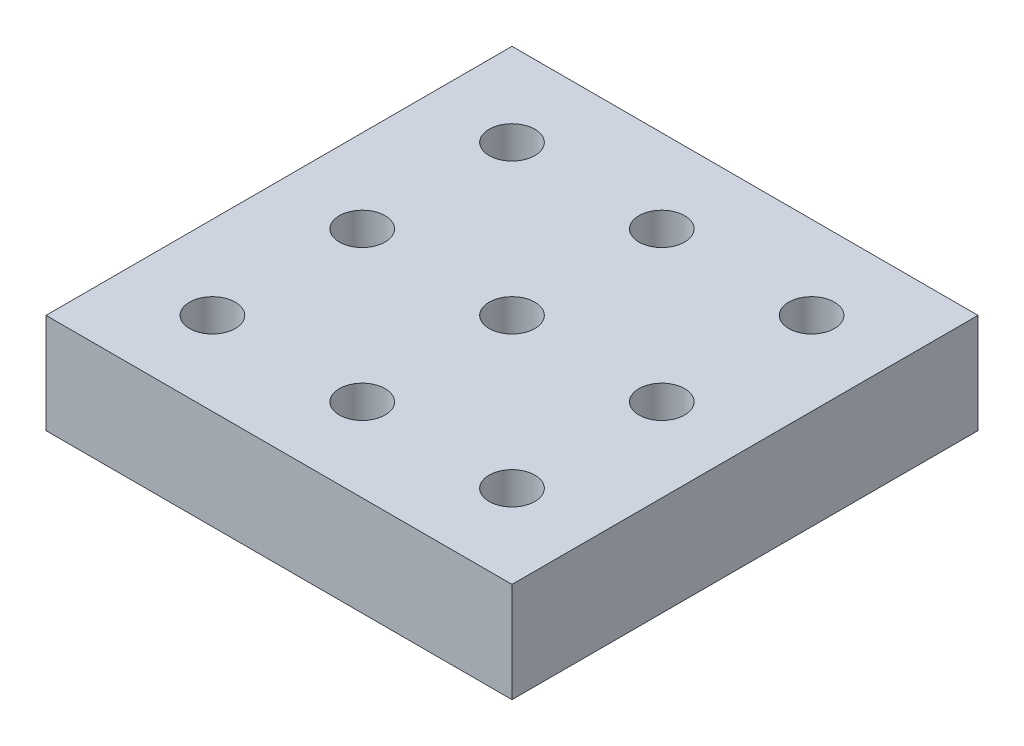
ISO-10303-21;
HEADER;
FILE_DESCRIPTION(('STEP AP214'),'2;1');
FILE_NAME('part.step','',(''),(''),'','','');
FILE_SCHEMA(('AUTOMOTIVE_DESIGN { 1 0 10303 214 1 1 1 1 }'));
ENDSEC;
DATA;
#1=APPLICATION_CONTEXT('core data for automotive mechanical design processes');
#2=APPLICATION_PROTOCOL_DEFINITION('international standard','automotive_design',2000,#1);
#3=PRODUCT_CONTEXT('',#1,'mechanical');
#4=PRODUCT('Part','Part','',(#3));
#5=PRODUCT_RELATED_PRODUCT_CATEGORY('part','',(#4));
#6=PRODUCT_DEFINITION_FORMATION('','',#4);
#7=PRODUCT_DEFINITION_CONTEXT('part definition',#1,'design');
#8=PRODUCT_DEFINITION('design','',#6,#7);
#9=PRODUCT_DEFINITION_SHAPE('','',#8);
#10=(LENGTH_UNIT() NAMED_UNIT(*) SI_UNIT(.MILLI.,.METRE.));
#11=(NAMED_UNIT(*) PLANE_ANGLE_UNIT() SI_UNIT($,.RADIAN.));
#12=(NAMED_UNIT(*) SI_UNIT($,.STERADIAN.) SOLID_ANGLE_UNIT());
#13=UNCERTAINTY_MEASURE_WITH_UNIT(LENGTH_MEASURE(1.E-05),#10,'distance_accuracy_value','');
#14=(GEOMETRIC_REPRESENTATION_CONTEXT(3) GLOBAL_UNCERTAINTY_ASSIGNED_CONTEXT((#13)) GLOBAL_UNIT_ASSIGNED_CONTEXT((#10,
#11,#12)) REPRESENTATION_CONTEXT('',''));
#15=CARTESIAN_POINT('',(0.,0.,0.));
#16=DIRECTION('',(0.,0.,1.));
#17=DIRECTION('',(1.,0.,0.));
#18=AXIS2_PLACEMENT_3D('',#15,#16,#17);
#19=CARTESIAN_POINT('',(0.,12.,0.));
#20=DIRECTION('',(0.,1.,0.));
#21=DIRECTION('',(0.,0.,1.));
#22=AXIS2_PLACEMENT_3D('',#19,#20,#21);
#23=PLANE('',#22);
#24=CARTESIAN_POINT('',(-42.9113924050631,12.,-19.2933634626204));
#25=DIRECTION('',(0.,1.,0.));
#26=DIRECTION('',(0.,0.,1.));
#27=AXIS2_PLACEMENT_3D('',#24,#25,#26);
#28=CIRCLE('',#27,2.75);
#29=CARTESIAN_POINT('',(-42.9113924050631,12.,-16.5433634626204));
#30=VERTEX_POINT('',#29);
#31=EDGE_CURVE('E151',#30,#30,#28,.T.);
#32=ORIENTED_EDGE('',*,*,#31,.F.);
#33=EDGE_LOOP('',(#32));
#34=FACE_BOUND('',#33,.T.);
#35=CARTESIAN_POINT('',(-24.9113924050629,12.,-1.29336346262041));
#36=DIRECTION('',(0.,1.,0.));
#37=DIRECTION('',(0.,0.,1.));
#38=AXIS2_PLACEMENT_3D('',#35,#36,#37);
#39=CIRCLE('',#38,2.75);
#40=CARTESIAN_POINT('',(-24.9113924050629,12.,1.4566365373796));
#41=VERTEX_POINT('',#40);
#42=EDGE_CURVE('E139',#41,#41,#39,.T.);
#43=ORIENTED_EDGE('',*,*,#42,.F.);
#44=EDGE_LOOP('',(#43));
#45=FACE_BOUND('',#44,.T.);
#46=CARTESIAN_POINT('',(-24.9113924050631,12.,-19.2933634626204));
#47=DIRECTION('',(0.,1.,0.));
#48=DIRECTION('',(0.,0.,1.));
#49=AXIS2_PLACEMENT_3D('',#46,#47,#48);
#50=CIRCLE('',#49,2.75);
#51=CARTESIAN_POINT('',(-24.9113924050631,12.,-16.5433634626204));
#52=VERTEX_POINT('',#51);
#53=EDGE_CURVE('E127',#52,#52,#50,.T.);
#54=ORIENTED_EDGE('',*,*,#53,.F.);
#55=EDGE_LOOP('',(#54));
#56=FACE_BOUND('',#55,.T.);
#57=CARTESIAN_POINT('',(-24.9113924050632,12.,-37.2933634626204));
#58=DIRECTION('',(0.,1.,0.));
#59=DIRECTION('',(0.,0.,1.));
#60=AXIS2_PLACEMENT_3D('',#57,#58,#59);
#61=CIRCLE('',#60,2.75);
#62=CARTESIAN_POINT('',(-24.9113924050632,12.,-34.5433634626204));
#63=VERTEX_POINT('',#62);
#64=EDGE_CURVE('E115',#63,#63,#61,.T.);
#65=ORIENTED_EDGE('',*,*,#64,.F.);
#66=EDGE_LOOP('',(#65));
#67=FACE_BOUND('',#66,.T.);
#68=DIRECTION('',(0.,0.,1.));
#69=VECTOR('',#68,1.);
#70=CARTESIAN_POINT('',(-52.9113924050632,12.,-47.2933634626204));
#71=LINE('',#70,#69);
#72=CARTESIAN_POINT('',(-52.9113924050632,12.,-47.2933634626204));
#73=VERTEX_POINT('',#72);
#74=CARTESIAN_POINT('',(-52.9113924050632,12.,8.7066365373796));
#75=VERTEX_POINT('',#74);
#76=EDGE_CURVE('E85',#73,#75,#71,.T.);
#77=ORIENTED_EDGE('',*,*,#76,.T.);
#78=DIRECTION('',(1.,0.,0.));
#79=VECTOR('',#78,1.);
#80=CARTESIAN_POINT('',(-52.9113924050632,12.,8.7066365373796));
#81=LINE('',#80,#79);
#82=CARTESIAN_POINT('',(3.08860759493677,12.,8.7066365373796));
#83=VERTEX_POINT('',#82);
#84=EDGE_CURVE('E80',#75,#83,#81,.T.);
#85=ORIENTED_EDGE('',*,*,#84,.T.);
#86=DIRECTION('',(0.,0.,-1.));
#87=VECTOR('',#86,1.);
#88=CARTESIAN_POINT('',(3.08860759493675,12.,-47.2933634626204));
#89=LINE('',#88,#87);
#90=CARTESIAN_POINT('',(3.08860759493675,12.,-47.2933634626204));
#91=VERTEX_POINT('',#90);
#92=EDGE_CURVE('E83',#83,#91,#89,.T.);
#93=ORIENTED_EDGE('',*,*,#92,.T.);
#94=DIRECTION('',(-1.,0.,0.));
#95=VECTOR('',#94,1.);
#96=CARTESIAN_POINT('',(-52.9113924050632,12.,-47.2933634626204));
#97=LINE('',#96,#95);
#98=EDGE_CURVE('E50',#91,#73,#97,.T.);
#99=ORIENTED_EDGE('',*,*,#98,.T.);
#100=EDGE_LOOP('',(#77,#85,#93,#99));
#101=FACE_BOUND('',#100,.T.);
#102=CARTESIAN_POINT('',(-42.9113924050632,12.,-37.2933634626204));
#103=DIRECTION('',(0.,1.,0.));
#104=DIRECTION('',(0.,0.,1.));
#105=AXIS2_PLACEMENT_3D('',#102,#103,#104);
#106=CIRCLE('',#105,2.75);
#107=CARTESIAN_POINT('',(-42.9113924050632,12.,-34.5433634626204));
#108=VERTEX_POINT('',#107);
#109=EDGE_CURVE('E100',#108,#108,#106,.T.);
#110=ORIENTED_EDGE('',*,*,#109,.F.);
#111=EDGE_LOOP('',(#110));
#112=FACE_BOUND('',#111,.T.);
#113=CARTESIAN_POINT('',(-6.91139240506325,12.,-37.2933634626204));
#114=DIRECTION('',(0.,1.,0.));
#115=DIRECTION('',(0.,0.,1.));
#116=AXIS2_PLACEMENT_3D('',#113,#114,#115);
#117=CIRCLE('',#116,2.75);
#118=CARTESIAN_POINT('',(-6.91139240506325,12.,-34.5433634626204));
#119=VERTEX_POINT('',#118);
#120=EDGE_CURVE('E121',#119,#119,#117,.T.);
#121=ORIENTED_EDGE('',*,*,#120,.F.);
#122=EDGE_LOOP('',(#121));
#123=FACE_BOUND('',#122,.T.);
#124=CARTESIAN_POINT('',(-6.91139240506306,12.,-19.2933634626204));
#125=DIRECTION('',(0.,1.,0.));
#126=DIRECTION('',(0.,0.,1.));
#127=AXIS2_PLACEMENT_3D('',#124,#125,#126);
#128=CIRCLE('',#127,2.75);
#129=CARTESIAN_POINT('',(-6.91139240506306,12.,-16.5433634626204));
#130=VERTEX_POINT('',#129);
#131=EDGE_CURVE('E133',#130,#130,#128,.T.);
#132=ORIENTED_EDGE('',*,*,#131,.F.);
#133=EDGE_LOOP('',(#132));
#134=FACE_BOUND('',#133,.T.);
#135=CARTESIAN_POINT('',(-6.91139240506287,12.,-1.29336346262041));
#136=DIRECTION('',(0.,1.,0.));
#137=DIRECTION('',(0.,0.,1.));
#138=AXIS2_PLACEMENT_3D('',#135,#136,#137);
#139=CIRCLE('',#138,2.75);
#140=CARTESIAN_POINT('',(-6.91139240506287,12.,1.4566365373796));
#141=VERTEX_POINT('',#140);
#142=EDGE_CURVE('E145',#141,#141,#139,.T.);
#143=ORIENTED_EDGE('',*,*,#142,.F.);
#144=EDGE_LOOP('',(#143));
#145=FACE_BOUND('',#144,.T.);
#146=CARTESIAN_POINT('',(-42.9113924050629,12.,-1.29336346262041));
#147=DIRECTION('',(0.,1.,0.));
#148=DIRECTION('',(0.,0.,1.));
#149=AXIS2_PLACEMENT_3D('',#146,#147,#148);
#150=CIRCLE('',#149,2.75);
#151=CARTESIAN_POINT('',(-42.9113924050629,12.,1.4566365373796));
#152=VERTEX_POINT('',#151);
#153=EDGE_CURVE('E157',#152,#152,#150,.T.);
#154=ORIENTED_EDGE('',*,*,#153,.F.);
#155=EDGE_LOOP('',(#154));
#156=FACE_BOUND('',#155,.T.);
#157=ADVANCED_FACE('F33',(#34,#45,#56,#67,#101,#112,#123,#134,#145,#156),#23,.T.);
#158=CARTESIAN_POINT('',(0.,0.,0.));
#159=DIRECTION('',(0.,1.,0.));
#160=DIRECTION('',(0.,0.,1.));
#161=AXIS2_PLACEMENT_3D('',#158,#159,#160);
#162=PLANE('',#161);
#163=DIRECTION('',(0.,0.,1.));
#164=VECTOR('',#163,1.);
#165=CARTESIAN_POINT('',(-52.9113924050632,0.,-47.2933634626204));
#166=LINE('',#165,#164);
#167=CARTESIAN_POINT('',(-52.9113924050632,0.,-47.2933634626204));
#168=VERTEX_POINT('',#167);
#169=CARTESIAN_POINT('',(-52.9113924050632,0.,8.7066365373796));
#170=VERTEX_POINT('',#169);
#171=EDGE_CURVE('E97',#168,#170,#166,.T.);
#172=ORIENTED_EDGE('',*,*,#171,.F.);
#173=DIRECTION('',(-1.,0.,0.));
#174=VECTOR('',#173,1.);
#175=CARTESIAN_POINT('',(-52.9113924050632,0.,-47.2933634626204));
#176=LINE('',#175,#174);
#177=CARTESIAN_POINT('',(3.08860759493675,0.,-47.2933634626204));
#178=VERTEX_POINT('',#177);
#179=EDGE_CURVE('E73',#178,#168,#176,.T.);
#180=ORIENTED_EDGE('',*,*,#179,.F.);
#181=DIRECTION('',(0.,0.,-1.));
#182=VECTOR('',#181,1.);
#183=CARTESIAN_POINT('',(3.08860759493675,0.,-47.2933634626204));
#184=LINE('',#183,#182);
#185=CARTESIAN_POINT('',(3.08860759493677,0.,8.7066365373796));
#186=VERTEX_POINT('',#185);
#187=EDGE_CURVE('E67',#186,#178,#184,.T.);
#188=ORIENTED_EDGE('',*,*,#187,.F.);
#189=DIRECTION('',(1.,0.,0.));
#190=VECTOR('',#189,1.);
#191=CARTESIAN_POINT('',(-52.9113924050632,0.,8.7066365373796));
#192=LINE('',#191,#190);
#193=EDGE_CURVE('E89',#170,#186,#192,.T.);
#194=ORIENTED_EDGE('',*,*,#193,.F.);
#195=EDGE_LOOP('',(#172,#180,#188,#194));
#196=FACE_BOUND('',#195,.T.);
#197=CARTESIAN_POINT('',(-42.9113924050632,0.,-37.2933634626204));
#198=DIRECTION('',(0.,1.,0.));
#199=DIRECTION('',(0.,0.,1.));
#200=AXIS2_PLACEMENT_3D('',#197,#198,#199);
#201=CIRCLE('',#200,2.75);
#202=CARTESIAN_POINT('',(-42.9113924050632,0.,-34.5433634626204));
#203=VERTEX_POINT('',#202);
#204=EDGE_CURVE('E112',#203,#203,#201,.T.);
#205=ORIENTED_EDGE('',*,*,#204,.T.);
#206=EDGE_LOOP('',(#205));
#207=FACE_BOUND('',#206,.T.);
#208=CARTESIAN_POINT('',(-24.9113924050632,0.,-37.2933634626204));
#209=DIRECTION('',(0.,1.,0.));
#210=DIRECTION('',(0.,0.,1.));
#211=AXIS2_PLACEMENT_3D('',#208,#209,#210);
#212=CIRCLE('',#211,2.75);
#213=CARTESIAN_POINT('',(-24.9113924050632,0.,-34.5433634626204));
#214=VERTEX_POINT('',#213);
#215=EDGE_CURVE('E118',#214,#214,#212,.T.);
#216=ORIENTED_EDGE('',*,*,#215,.T.);
#217=EDGE_LOOP('',(#216));
#218=FACE_BOUND('',#217,.T.);
#219=CARTESIAN_POINT('',(-6.91139240506325,0.,-37.2933634626204));
#220=DIRECTION('',(0.,1.,0.));
#221=DIRECTION('',(0.,0.,1.));
#222=AXIS2_PLACEMENT_3D('',#219,#220,#221);
#223=CIRCLE('',#222,2.75);
#224=CARTESIAN_POINT('',(-6.91139240506325,0.,-34.5433634626204));
#225=VERTEX_POINT('',#224);
#226=EDGE_CURVE('E124',#225,#225,#223,.T.);
#227=ORIENTED_EDGE('',*,*,#226,.T.);
#228=EDGE_LOOP('',(#227));
#229=FACE_BOUND('',#228,.T.);
#230=CARTESIAN_POINT('',(-24.9113924050631,0.,-19.2933634626204));
#231=DIRECTION('',(0.,1.,0.));
#232=DIRECTION('',(0.,0.,1.));
#233=AXIS2_PLACEMENT_3D('',#230,#231,#232);
#234=CIRCLE('',#233,2.75);
#235=CARTESIAN_POINT('',(-24.9113924050631,0.,-16.5433634626204));
#236=VERTEX_POINT('',#235);
#237=EDGE_CURVE('E130',#236,#236,#234,.T.);
#238=ORIENTED_EDGE('',*,*,#237,.T.);
#239=EDGE_LOOP('',(#238));
#240=FACE_BOUND('',#239,.T.);
#241=CARTESIAN_POINT('',(-6.91139240506306,0.,-19.2933634626204));
#242=DIRECTION('',(0.,1.,0.));
#243=DIRECTION('',(0.,0.,1.));
#244=AXIS2_PLACEMENT_3D('',#241,#242,#243);
#245=CIRCLE('',#244,2.75);
#246=CARTESIAN_POINT('',(-6.91139240506306,0.,-16.5433634626204));
#247=VERTEX_POINT('',#246);
#248=EDGE_CURVE('E136',#247,#247,#245,.T.);
#249=ORIENTED_EDGE('',*,*,#248,.T.);
#250=EDGE_LOOP('',(#249));
#251=FACE_BOUND('',#250,.T.);
#252=CARTESIAN_POINT('',(-24.9113924050629,0.,-1.29336346262041));
#253=DIRECTION('',(0.,1.,0.));
#254=DIRECTION('',(0.,0.,1.));
#255=AXIS2_PLACEMENT_3D('',#252,#253,#254);
#256=CIRCLE('',#255,2.75);
#257=CARTESIAN_POINT('',(-24.9113924050629,0.,1.4566365373796));
#258=VERTEX_POINT('',#257);
#259=EDGE_CURVE('E142',#258,#258,#256,.T.);
#260=ORIENTED_EDGE('',*,*,#259,.T.);
#261=EDGE_LOOP('',(#260));
#262=FACE_BOUND('',#261,.T.);
#263=CARTESIAN_POINT('',(-6.91139240506287,0.,-1.29336346262041));
#264=DIRECTION('',(0.,1.,0.));
#265=DIRECTION('',(0.,0.,1.));
#266=AXIS2_PLACEMENT_3D('',#263,#264,#265);
#267=CIRCLE('',#266,2.75);
#268=CARTESIAN_POINT('',(-6.91139240506287,0.,1.4566365373796));
#269=VERTEX_POINT('',#268);
#270=EDGE_CURVE('E148',#269,#269,#267,.T.);
#271=ORIENTED_EDGE('',*,*,#270,.T.);
#272=EDGE_LOOP('',(#271));
#273=FACE_BOUND('',#272,.T.);
#274=CARTESIAN_POINT('',(-42.9113924050631,0.,-19.2933634626204));
#275=DIRECTION('',(0.,1.,0.));
#276=DIRECTION('',(0.,0.,1.));
#277=AXIS2_PLACEMENT_3D('',#274,#275,#276);
#278=CIRCLE('',#277,2.75);
#279=CARTESIAN_POINT('',(-42.9113924050631,0.,-16.5433634626204));
#280=VERTEX_POINT('',#279);
#281=EDGE_CURVE('E154',#280,#280,#278,.T.);
#282=ORIENTED_EDGE('',*,*,#281,.T.);
#283=EDGE_LOOP('',(#282));
#284=FACE_BOUND('',#283,.T.);
#285=CARTESIAN_POINT('',(-42.9113924050629,0.,-1.29336346262041));
#286=DIRECTION('',(0.,1.,0.));
#287=DIRECTION('',(0.,0.,1.));
#288=AXIS2_PLACEMENT_3D('',#285,#286,#287);
#289=CIRCLE('',#288,2.75);
#290=CARTESIAN_POINT('',(-42.9113924050629,0.,1.4566365373796));
#291=VERTEX_POINT('',#290);
#292=EDGE_CURVE('E160',#291,#291,#289,.T.);
#293=ORIENTED_EDGE('',*,*,#292,.T.);
#294=EDGE_LOOP('',(#293));
#295=FACE_BOUND('',#294,.T.);
#296=ADVANCED_FACE('F108',(#196,#207,#218,#229,#240,#251,#262,#273,#284,#295),#162,.F.);
#297=CARTESIAN_POINT('',(-52.9113924050632,12.,-47.2933634626204));
#298=DIRECTION('',(1.,0.,0.));
#299=DIRECTION('',(0.,0.,-1.));
#300=AXIS2_PLACEMENT_3D('',#297,#298,#299);
#301=PLANE('',#300);
#302=ORIENTED_EDGE('',*,*,#171,.T.);
#303=DIRECTION('',(0.,-1.,0.));
#304=VECTOR('',#303,1.);
#305=CARTESIAN_POINT('',(-52.9113924050632,12.,8.7066365373796));
#306=LINE('',#305,#304);
#307=EDGE_CURVE('E11',#75,#170,#306,.T.);
#308=ORIENTED_EDGE('',*,*,#307,.F.);
#309=ORIENTED_EDGE('',*,*,#76,.F.);
#310=DIRECTION('',(0.,-1.,0.));
#311=VECTOR('',#310,1.);
#312=CARTESIAN_POINT('',(-52.9113924050632,12.,-47.2933634626204));
#313=LINE('',#312,#311);
#314=EDGE_CURVE('E93',#73,#168,#313,.T.);
#315=ORIENTED_EDGE('',*,*,#314,.T.);
#316=EDGE_LOOP('',(#302,#308,#309,#315));
#317=FACE_BOUND('',#316,.T.);
#318=ADVANCED_FACE('F35',(#317),#301,.F.);
#319=CARTESIAN_POINT('',(-52.9113924050632,12.,8.7066365373796));
#320=DIRECTION('',(0.,0.,-1.));
#321=DIRECTION('',(-1.,0.,0.));
#322=AXIS2_PLACEMENT_3D('',#319,#320,#321);
#323=PLANE('',#322);
#324=ORIENTED_EDGE('',*,*,#193,.T.);
#325=DIRECTION('',(0.,-1.,0.));
#326=VECTOR('',#325,1.);
#327=CARTESIAN_POINT('',(3.08860759493677,12.,8.7066365373796));
#328=LINE('',#327,#326);
#329=EDGE_CURVE('E42',#83,#186,#328,.T.);
#330=ORIENTED_EDGE('',*,*,#329,.F.);
#331=ORIENTED_EDGE('',*,*,#84,.F.);
#332=ORIENTED_EDGE('',*,*,#307,.T.);
#333=EDGE_LOOP('',(#324,#330,#331,#332));
#334=FACE_BOUND('',#333,.T.);
#335=ADVANCED_FACE('F88',(#334),#323,.F.);
#336=CARTESIAN_POINT('',(3.08860759493675,12.,-47.2933634626204));
#337=DIRECTION('',(-1.,0.,0.));
#338=DIRECTION('',(0.,0.,1.));
#339=AXIS2_PLACEMENT_3D('',#336,#337,#338);
#340=PLANE('',#339);
#341=ORIENTED_EDGE('',*,*,#187,.T.);
#342=DIRECTION('',(0.,-1.,0.));
#343=VECTOR('',#342,1.);
#344=CARTESIAN_POINT('',(3.08860759493675,12.,-47.2933634626204));
#345=LINE('',#344,#343);
#346=EDGE_CURVE('E90',#91,#178,#345,.T.);
#347=ORIENTED_EDGE('',*,*,#346,.F.);
#348=ORIENTED_EDGE('',*,*,#92,.F.);
#349=ORIENTED_EDGE('',*,*,#329,.T.);
#350=EDGE_LOOP('',(#341,#347,#348,#349));
#351=FACE_BOUND('',#350,.T.);
#352=ADVANCED_FACE('F91',(#351),#340,.F.);
#353=CARTESIAN_POINT('',(-52.9113924050632,12.,-47.2933634626204));
#354=DIRECTION('',(0.,0.,1.));
#355=DIRECTION('',(1.,0.,0.));
#356=AXIS2_PLACEMENT_3D('',#353,#354,#355);
#357=PLANE('',#356);
#358=ORIENTED_EDGE('',*,*,#179,.T.);
#359=ORIENTED_EDGE('',*,*,#314,.F.);
#360=ORIENTED_EDGE('',*,*,#98,.F.);
#361=ORIENTED_EDGE('',*,*,#346,.T.);
#362=EDGE_LOOP('',(#358,#359,#360,#361));
#363=FACE_BOUND('',#362,.T.);
#364=ADVANCED_FACE('F105',(#363),#357,.F.);
#365=CARTESIAN_POINT('',(-42.9113924050632,12.,-37.2933634626204));
#366=DIRECTION('',(0.,-1.,0.));
#367=DIRECTION('',(0.,0.,-1.));
#368=AXIS2_PLACEMENT_3D('',#365,#366,#367);
#369=CYLINDRICAL_SURFACE('',#368,2.75);
#370=ORIENTED_EDGE('',*,*,#109,.T.);
#371=EDGE_LOOP('',(#370));
#372=FACE_BOUND('',#371,.T.);
#373=ORIENTED_EDGE('',*,*,#204,.F.);
#374=EDGE_LOOP('',(#373));
#375=FACE_BOUND('',#374,.T.);
#376=ADVANCED_FACE('F179',(#372,#375),#369,.F.);
#377=CARTESIAN_POINT('',(-24.9113924050632,12.,-37.2933634626204));
#378=DIRECTION('',(0.,-1.,0.));
#379=DIRECTION('',(0.,0.,-1.));
#380=AXIS2_PLACEMENT_3D('',#377,#378,#379);
#381=CYLINDRICAL_SURFACE('',#380,2.75);
#382=ORIENTED_EDGE('',*,*,#64,.T.);
#383=EDGE_LOOP('',(#382));
#384=FACE_BOUND('',#383,.T.);
#385=ORIENTED_EDGE('',*,*,#215,.F.);
#386=EDGE_LOOP('',(#385));
#387=FACE_BOUND('',#386,.T.);
#388=ADVANCED_FACE('F225',(#384,#387),#381,.F.);
#389=CARTESIAN_POINT('',(-6.91139240506325,12.,-37.2933634626204));
#390=DIRECTION('',(0.,-1.,0.));
#391=DIRECTION('',(0.,0.,-1.));
#392=AXIS2_PLACEMENT_3D('',#389,#390,#391);
#393=CYLINDRICAL_SURFACE('',#392,2.75);
#394=ORIENTED_EDGE('',*,*,#120,.T.);
#395=EDGE_LOOP('',(#394));
#396=FACE_BOUND('',#395,.T.);
#397=ORIENTED_EDGE('',*,*,#226,.F.);
#398=EDGE_LOOP('',(#397));
#399=FACE_BOUND('',#398,.T.);
#400=ADVANCED_FACE('F233',(#396,#399),#393,.F.);
#401=CARTESIAN_POINT('',(-24.9113924050631,12.,-19.2933634626204));
#402=DIRECTION('',(0.,-1.,0.));
#403=DIRECTION('',(0.,0.,-1.));
#404=AXIS2_PLACEMENT_3D('',#401,#402,#403);
#405=CYLINDRICAL_SURFACE('',#404,2.75);
#406=ORIENTED_EDGE('',*,*,#53,.T.);
#407=EDGE_LOOP('',(#406));
#408=FACE_BOUND('',#407,.T.);
#409=ORIENTED_EDGE('',*,*,#237,.F.);
#410=EDGE_LOOP('',(#409));
#411=FACE_BOUND('',#410,.T.);
#412=ADVANCED_FACE('F241',(#408,#411),#405,.F.);
#413=CARTESIAN_POINT('',(-6.91139240506306,12.,-19.2933634626204));
#414=DIRECTION('',(0.,-1.,0.));
#415=DIRECTION('',(0.,0.,-1.));
#416=AXIS2_PLACEMENT_3D('',#413,#414,#415);
#417=CYLINDRICAL_SURFACE('',#416,2.75);
#418=ORIENTED_EDGE('',*,*,#131,.T.);
#419=EDGE_LOOP('',(#418));
#420=FACE_BOUND('',#419,.T.);
#421=ORIENTED_EDGE('',*,*,#248,.F.);
#422=EDGE_LOOP('',(#421));
#423=FACE_BOUND('',#422,.T.);
#424=ADVANCED_FACE('F250',(#420,#423),#417,.F.);
#425=CARTESIAN_POINT('',(-24.9113924050629,12.,-1.29336346262041));
#426=DIRECTION('',(0.,-1.,0.));
#427=DIRECTION('',(0.,0.,-1.));
#428=AXIS2_PLACEMENT_3D('',#425,#426,#427);
#429=CYLINDRICAL_SURFACE('',#428,2.75);
#430=ORIENTED_EDGE('',*,*,#42,.T.);
#431=EDGE_LOOP('',(#430));
#432=FACE_BOUND('',#431,.T.);
#433=ORIENTED_EDGE('',*,*,#259,.F.);
#434=EDGE_LOOP('',(#433));
#435=FACE_BOUND('',#434,.T.);
#436=ADVANCED_FACE('F259',(#432,#435),#429,.F.);
#437=CARTESIAN_POINT('',(-6.91139240506287,12.,-1.29336346262041));
#438=DIRECTION('',(0.,-1.,0.));
#439=DIRECTION('',(0.,0.,-1.));
#440=AXIS2_PLACEMENT_3D('',#437,#438,#439);
#441=CYLINDRICAL_SURFACE('',#440,2.75);
#442=ORIENTED_EDGE('',*,*,#142,.T.);
#443=EDGE_LOOP('',(#442));
#444=FACE_BOUND('',#443,.T.);
#445=ORIENTED_EDGE('',*,*,#270,.F.);
#446=EDGE_LOOP('',(#445));
#447=FACE_BOUND('',#446,.T.);
#448=ADVANCED_FACE('F268',(#444,#447),#441,.F.);
#449=CARTESIAN_POINT('',(-42.9113924050631,12.,-19.2933634626204));
#450=DIRECTION('',(0.,-1.,0.));
#451=DIRECTION('',(0.,0.,-1.));
#452=AXIS2_PLACEMENT_3D('',#449,#450,#451);
#453=CYLINDRICAL_SURFACE('',#452,2.75);
#454=ORIENTED_EDGE('',*,*,#31,.T.);
#455=EDGE_LOOP('',(#454));
#456=FACE_BOUND('',#455,.T.);
#457=ORIENTED_EDGE('',*,*,#281,.F.);
#458=EDGE_LOOP('',(#457));
#459=FACE_BOUND('',#458,.T.);
#460=ADVANCED_FACE('F277',(#456,#459),#453,.F.);
#461=CARTESIAN_POINT('',(-42.9113924050629,12.,-1.29336346262041));
#462=DIRECTION('',(0.,-1.,0.));
#463=DIRECTION('',(0.,0.,-1.));
#464=AXIS2_PLACEMENT_3D('',#461,#462,#463);
#465=CYLINDRICAL_SURFACE('',#464,2.75);
#466=ORIENTED_EDGE('',*,*,#153,.T.);
#467=EDGE_LOOP('',(#466));
#468=FACE_BOUND('',#467,.T.);
#469=ORIENTED_EDGE('',*,*,#292,.F.);
#470=EDGE_LOOP('',(#469));
#471=FACE_BOUND('',#470,.T.);
#472=ADVANCED_FACE('F166',(#468,#471),#465,.F.);
#473=CLOSED_SHELL('',(#157,#296,#318,#335,#352,#364,#376,#388,#400,#412,#424,#436,#448,#460,#472));
#474=MANIFOLD_SOLID_BREP('B2',#473);
#475=ADVANCED_BREP_SHAPE_REPRESENTATION('',(#18,#474),#14);
#476=SHAPE_DEFINITION_REPRESENTATION(#9,#475);
ENDSEC;
END-ISO-10303-21;
